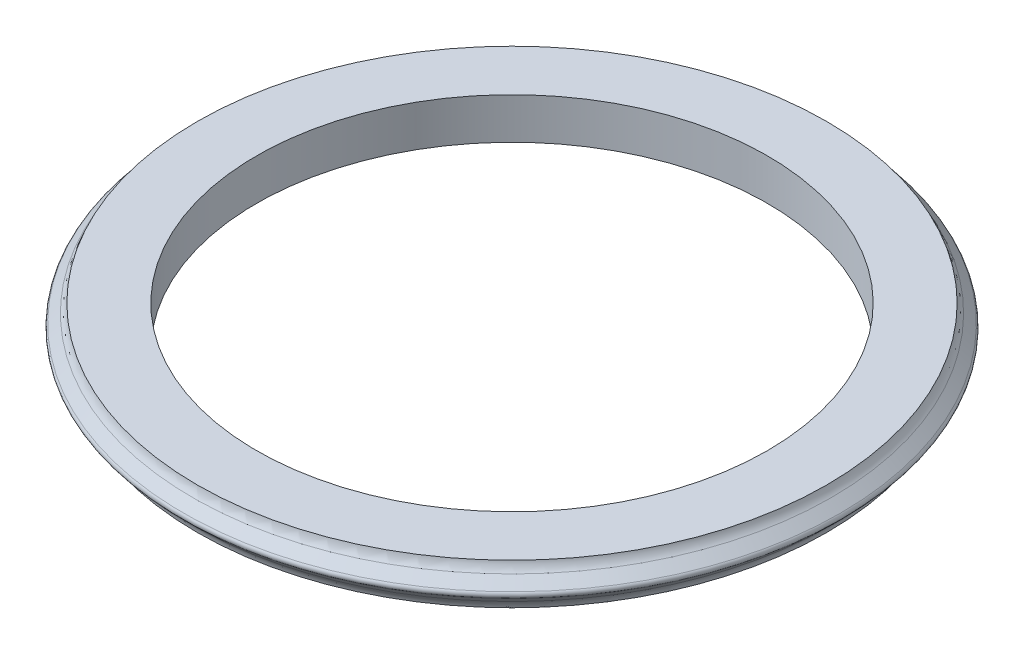
ISO-10303-21;
HEADER;
FILE_DESCRIPTION(('STEP AP214'),'2;1');
FILE_NAME('part.step','',(''),(''),'','','');
FILE_SCHEMA(('AUTOMOTIVE_DESIGN { 1 0 10303 214 1 1 1 1 }'));
ENDSEC;
DATA;
#1=APPLICATION_CONTEXT('core data for automotive mechanical design processes');
#2=APPLICATION_PROTOCOL_DEFINITION('international standard','automotive_design',2000,#1);
#3=PRODUCT_CONTEXT('',#1,'mechanical');
#4=PRODUCT('Part','Part','',(#3));
#5=PRODUCT_RELATED_PRODUCT_CATEGORY('part','',(#4));
#6=PRODUCT_DEFINITION_FORMATION('','',#4);
#7=PRODUCT_DEFINITION_CONTEXT('part definition',#1,'design');
#8=PRODUCT_DEFINITION('design','',#6,#7);
#9=PRODUCT_DEFINITION_SHAPE('','',#8);
#10=(LENGTH_UNIT() NAMED_UNIT(*) SI_UNIT(.MILLI.,.METRE.));
#11=(NAMED_UNIT(*) PLANE_ANGLE_UNIT() SI_UNIT($,.RADIAN.));
#12=(NAMED_UNIT(*) SI_UNIT($,.STERADIAN.) SOLID_ANGLE_UNIT());
#13=UNCERTAINTY_MEASURE_WITH_UNIT(LENGTH_MEASURE(1.E-05),#10,'distance_accuracy_value','');
#14=(GEOMETRIC_REPRESENTATION_CONTEXT(3) GLOBAL_UNCERTAINTY_ASSIGNED_CONTEXT((#13)) GLOBAL_UNIT_ASSIGNED_CONTEXT((#10,
#11,#12)) REPRESENTATION_CONTEXT('',''));
#15=CARTESIAN_POINT('',(0.,0.,0.));
#16=DIRECTION('',(0.,0.,1.));
#17=DIRECTION('',(1.,0.,0.));
#18=AXIS2_PLACEMENT_3D('',#15,#16,#17);
#19=CARTESIAN_POINT('',(19.1035533905933,0.,0.));
#20=DIRECTION('',(0.,-1.,0.));
#21=DIRECTION('',(1.,0.,0.));
#22=AXIS2_PLACEMENT_3D('',#19,#20,#21);
#23=PLANE('',#22);
#24=CARTESIAN_POINT('',(0.,0.,0.));
#25=DIRECTION('',(0.,-1.,0.));
#26=DIRECTION('',(1.,0.,0.));
#27=AXIS2_PLACEMENT_3D('',#24,#25,#26);
#28=CIRCLE('',#27,19.1035533905933);
#29=CARTESIAN_POINT('',(19.1035533905933,0.,0.));
#30=VERTEX_POINT('',#29);
#31=EDGE_CURVE('E26',#30,#30,#28,.T.);
#32=ORIENTED_EDGE('',*,*,#31,.T.);
#33=EDGE_LOOP('',(#32));
#34=FACE_BOUND('',#33,.T.);
#35=CARTESIAN_POINT('',(0.,0.,0.));
#36=DIRECTION('',(0.,-1.,0.));
#37=DIRECTION('',(1.,0.,0.));
#38=AXIS2_PLACEMENT_3D('',#35,#36,#37);
#39=CIRCLE('',#38,15.5);
#40=CARTESIAN_POINT('',(15.5,0.,0.));
#41=VERTEX_POINT('',#40);
#42=EDGE_CURVE('E44',#41,#41,#39,.T.);
#43=ORIENTED_EDGE('',*,*,#42,.F.);
#44=EDGE_LOOP('',(#43));
#45=FACE_BOUND('',#44,.T.);
#46=ADVANCED_FACE('F15',(#34,#45),#23,.T.);
#47=CARTESIAN_POINT('',(0.,0.249999999999992,0.));
#48=DIRECTION('',(0.,1.,0.));
#49=DIRECTION('',(-1.,0.,0.));
#50=AXIS2_PLACEMENT_3D('',#47,#48,#49);
#51=CONICAL_SURFACE('',#50,19.1035533905933,0.785398163397449);
#52=CARTESIAN_POINT('',(0.,0.526437037773792,0.));
#53=DIRECTION('',(0.,1.,0.));
#54=DIRECTION('',(-1.,0.,0.));
#55=AXIS2_PLACEMENT_3D('',#52,#53,#54);
#56=CIRCLE('',#55,19.3799904283671);
#57=CARTESIAN_POINT('',(-19.3799904283671,0.52643703777379,0.));
#58=VERTEX_POINT('',#57);
#59=EDGE_CURVE('E22',#58,#58,#56,.T.);
#60=ORIENTED_EDGE('',*,*,#59,.T.);
#61=EDGE_LOOP('',(#60));
#62=FACE_BOUND('',#61,.T.);
#63=CARTESIAN_POINT('',(0.,1.07322330470335,0.));
#64=DIRECTION('',(0.,-1.,0.));
#65=DIRECTION('',(1.,0.,0.));
#66=AXIS2_PLACEMENT_3D('',#63,#64,#65);
#67=CIRCLE('',#66,19.9267766952966);
#68=CARTESIAN_POINT('',(19.9267766952966,1.07322330470336,0.));
#69=VERTEX_POINT('',#68);
#70=EDGE_CURVE('E30',#69,#69,#67,.T.);
#71=ORIENTED_EDGE('',*,*,#70,.T.);
#72=EDGE_LOOP('',(#71));
#73=FACE_BOUND('',#72,.T.);
#74=ADVANCED_FACE('F52',(#62,#73),#51,.T.);
#75=CARTESIAN_POINT('',(0.,1.25,0.));
#76=DIRECTION('',(0.,-1.,0.));
#77=DIRECTION('',(1.,0.,0.));
#78=AXIS2_PLACEMENT_3D('',#75,#76,#77);
#79=TOROIDAL_SURFACE('',#78,19.75,0.25);
#80=CARTESIAN_POINT('',(0.,1.42677669529663,0.));
#81=DIRECTION('',(0.,-1.,0.));
#82=DIRECTION('',(1.,0.,0.));
#83=AXIS2_PLACEMENT_3D('',#80,#81,#82);
#84=CIRCLE('',#83,19.9267766952966);
#85=CARTESIAN_POINT('',(19.9267766952966,1.42677669529663,0.));
#86=VERTEX_POINT('',#85);
#87=EDGE_CURVE('E35',#86,#86,#84,.T.);
#88=ORIENTED_EDGE('',*,*,#87,.T.);
#89=EDGE_LOOP('',(#88));
#90=FACE_BOUND('',#89,.T.);
#91=ORIENTED_EDGE('',*,*,#70,.F.);
#92=EDGE_LOOP('',(#91));
#93=FACE_BOUND('',#92,.T.);
#94=ADVANCED_FACE('F60',(#90,#93),#79,.T.);
#95=CARTESIAN_POINT('',(0.,1.42677669529663,0.));
#96=DIRECTION('',(0.,-1.,0.));
#97=DIRECTION('',(1.,0.,0.));
#98=AXIS2_PLACEMENT_3D('',#95,#96,#97);
#99=CONICAL_SURFACE('',#98,19.9267766952966,0.785398163397449);
#100=CARTESIAN_POINT('',(0.,1.97356296222612,0.));
#101=DIRECTION('',(0.,-1.,0.));
#102=DIRECTION('',(1.,0.,0.));
#103=AXIS2_PLACEMENT_3D('',#100,#101,#102);
#104=CIRCLE('',#103,19.3799904283672);
#105=CARTESIAN_POINT('',(19.3799904283672,1.97356296222612,0.));
#106=VERTEX_POINT('',#105);
#107=EDGE_CURVE('E10',#106,#106,#104,.T.);
#108=ORIENTED_EDGE('',*,*,#107,.T.);
#109=EDGE_LOOP('',(#108));
#110=FACE_BOUND('',#109,.T.);
#111=ORIENTED_EDGE('',*,*,#87,.F.);
#112=EDGE_LOOP('',(#111));
#113=FACE_BOUND('',#112,.T.);
#114=ADVANCED_FACE('F80',(#110,#113),#99,.T.);
#115=CARTESIAN_POINT('',(15.5,2.5,0.));
#116=DIRECTION('',(0.,1.,0.));
#117=DIRECTION('',(-1.,0.,0.));
#118=AXIS2_PLACEMENT_3D('',#115,#116,#117);
#119=PLANE('',#118);
#120=CARTESIAN_POINT('',(0.,2.5,0.));
#121=DIRECTION('',(0.,-1.,0.));
#122=DIRECTION('',(1.,0.,0.));
#123=AXIS2_PLACEMENT_3D('',#120,#121,#122);
#124=CIRCLE('',#123,15.5);
#125=CARTESIAN_POINT('',(15.5,2.5,0.));
#126=VERTEX_POINT('',#125);
#127=EDGE_CURVE('E41',#126,#126,#124,.T.);
#128=ORIENTED_EDGE('',*,*,#127,.T.);
#129=EDGE_LOOP('',(#128));
#130=FACE_BOUND('',#129,.T.);
#131=CARTESIAN_POINT('',(0.,2.5,0.));
#132=DIRECTION('',(0.,-1.,0.));
#133=DIRECTION('',(1.,0.,0.));
#134=AXIS2_PLACEMENT_3D('',#131,#132,#133);
#135=CIRCLE('',#134,19.1035533905933);
#136=CARTESIAN_POINT('',(19.1035533905933,2.5,0.));
#137=VERTEX_POINT('',#136);
#138=EDGE_CURVE('E38',#137,#137,#135,.T.);
#139=ORIENTED_EDGE('',*,*,#138,.F.);
#140=EDGE_LOOP('',(#139));
#141=FACE_BOUND('',#140,.T.);
#142=ADVANCED_FACE('F72',(#130,#141),#119,.T.);
#143=CARTESIAN_POINT('',(0.,0.,0.));
#144=DIRECTION('',(0.,-1.,0.));
#145=DIRECTION('',(1.,0.,0.));
#146=AXIS2_PLACEMENT_3D('',#143,#144,#145);
#147=CYLINDRICAL_SURFACE('',#146,15.5);
#148=ORIENTED_EDGE('',*,*,#42,.T.);
#149=EDGE_LOOP('',(#148));
#150=FACE_BOUND('',#149,.T.);
#151=ORIENTED_EDGE('',*,*,#127,.F.);
#152=EDGE_LOOP('',(#151));
#153=FACE_BOUND('',#152,.T.);
#154=ADVANCED_FACE('F48',(#150,#153),#147,.F.);
#155=CARTESIAN_POINT('',(0.,-0.180669743412756,0.));
#156=DIRECTION('',(0.,-1.,0.));
#157=DIRECTION('',(1.,0.,0.));
#158=AXIS2_PLACEMENT_3D('',#155,#156,#157);
#159=TOROIDAL_SURFACE('',#158,20.0870972095536,1.);
#160=ORIENTED_EDGE('',*,*,#59,.F.);
#161=EDGE_LOOP('',(#160));
#162=FACE_BOUND('',#161,.T.);
#163=ORIENTED_EDGE('',*,*,#31,.F.);
#164=EDGE_LOOP('',(#163));
#165=FACE_BOUND('',#164,.T.);
#166=ADVANCED_FACE('F63',(#162,#165),#159,.F.);
#167=CARTESIAN_POINT('',(0.,2.68066974341267,0.));
#168=DIRECTION('',(0.,1.,0.));
#169=DIRECTION('',(-1.,0.,0.));
#170=AXIS2_PLACEMENT_3D('',#167,#168,#169);
#171=TOROIDAL_SURFACE('',#170,20.0870972095537,1.);
#172=ORIENTED_EDGE('',*,*,#138,.T.);
#173=EDGE_LOOP('',(#172));
#174=FACE_BOUND('',#173,.T.);
#175=ORIENTED_EDGE('',*,*,#107,.F.);
#176=EDGE_LOOP('',(#175));
#177=FACE_BOUND('',#176,.T.);
#178=ADVANCED_FACE('F17',(#174,#177),#171,.F.);
#179=CLOSED_SHELL('',(#46,#74,#94,#114,#142,#154,#166,#178));
#180=MANIFOLD_SOLID_BREP('B1',#179);
#181=ADVANCED_BREP_SHAPE_REPRESENTATION('',(#18,#180),#14);
#182=SHAPE_DEFINITION_REPRESENTATION(#9,#181);
ENDSEC;
END-ISO-10303-21;
